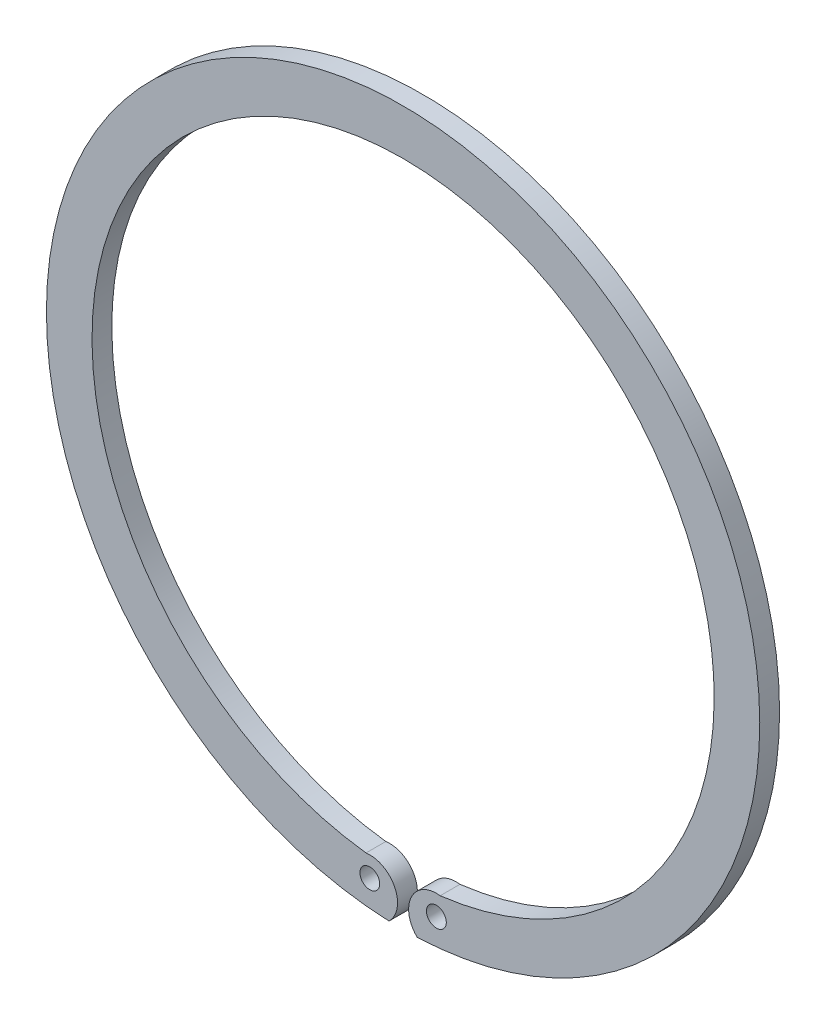
ISO-10303-21;
HEADER;
FILE_DESCRIPTION(('STEP AP214'),'2;1');
FILE_NAME('part.step','',(''),(''),'','','');
FILE_SCHEMA(('AUTOMOTIVE_DESIGN { 1 0 10303 214 1 1 1 1 }'));
ENDSEC;
DATA;
#1=APPLICATION_CONTEXT('core data for automotive mechanical design processes');
#2=APPLICATION_PROTOCOL_DEFINITION('international standard','automotive_design',2000,#1);
#3=PRODUCT_CONTEXT('',#1,'mechanical');
#4=PRODUCT('Part','Part','',(#3));
#5=PRODUCT_RELATED_PRODUCT_CATEGORY('part','',(#4));
#6=PRODUCT_DEFINITION_FORMATION('','',#4);
#7=PRODUCT_DEFINITION_CONTEXT('part definition',#1,'design');
#8=PRODUCT_DEFINITION('design','',#6,#7);
#9=PRODUCT_DEFINITION_SHAPE('','',#8);
#10=(LENGTH_UNIT() NAMED_UNIT(*) SI_UNIT(.MILLI.,.METRE.));
#11=(NAMED_UNIT(*) PLANE_ANGLE_UNIT() SI_UNIT($,.RADIAN.));
#12=(NAMED_UNIT(*) SI_UNIT($,.STERADIAN.) SOLID_ANGLE_UNIT());
#13=UNCERTAINTY_MEASURE_WITH_UNIT(LENGTH_MEASURE(1.E-05),#10,'distance_accuracy_value','');
#14=(GEOMETRIC_REPRESENTATION_CONTEXT(3) GLOBAL_UNCERTAINTY_ASSIGNED_CONTEXT((#13)) GLOBAL_UNIT_ASSIGNED_CONTEXT((#10,
#11,#12)) REPRESENTATION_CONTEXT('',''));
#15=CARTESIAN_POINT('',(0.,0.,0.));
#16=DIRECTION('',(0.,0.,1.));
#17=DIRECTION('',(1.,0.,0.));
#18=AXIS2_PLACEMENT_3D('',#15,#16,#17);
#19=CARTESIAN_POINT('',(0.,0.,-4.));
#20=DIRECTION('',(0.,0.,-1.));
#21=DIRECTION('',(1.,0.,0.));
#22=AXIS2_PLACEMENT_3D('',#19,#20,#21);
#23=CYLINDRICAL_SURFACE('',#22,62.8);
#24=DIRECTION('',(0.,0.,1.));
#25=VECTOR('',#24,1.);
#26=CARTESIAN_POINT('',(7.48440078036265,-62.3524157106917,2.));
#27=LINE('',#26,#25);
#28=CARTESIAN_POINT('',(7.48440078036292,-62.3524157106916,0.));
#29=VERTEX_POINT('',#28);
#30=CARTESIAN_POINT('',(7.48440078036265,-62.3524157106917,4.));
#31=VERTEX_POINT('',#30);
#32=EDGE_CURVE('E84',#29,#31,#27,.T.);
#33=ORIENTED_EDGE('',*,*,#32,.T.);
#34=CARTESIAN_POINT('',(0.,0.,4.));
#35=DIRECTION('',(0.,0.,-1.));
#36=DIRECTION('',(1.,0.,0.));
#37=AXIS2_PLACEMENT_3D('',#34,#35,#36);
#38=CIRCLE('',#37,62.8);
#39=CARTESIAN_POINT('',(-7.48440078036265,-62.3524157106917,4.));
#40=VERTEX_POINT('',#39);
#41=EDGE_CURVE('E78',#40,#31,#38,.T.);
#42=ORIENTED_EDGE('',*,*,#41,.F.);
#43=DIRECTION('',(0.,0.,-1.));
#44=VECTOR('',#43,1.);
#45=CARTESIAN_POINT('',(-7.48440078036265,-62.3524157106917,2.));
#46=LINE('',#45,#44);
#47=CARTESIAN_POINT('',(-7.48440078036265,-62.3524157106917,0.));
#48=VERTEX_POINT('',#47);
#49=EDGE_CURVE('E63',#40,#48,#46,.T.);
#50=ORIENTED_EDGE('',*,*,#49,.T.);
#51=CARTESIAN_POINT('',(0.,0.,0.));
#52=DIRECTION('',(0.,0.,1.));
#53=DIRECTION('',(1.,0.,0.));
#54=AXIS2_PLACEMENT_3D('',#51,#52,#53);
#55=CIRCLE('',#54,62.8);
#56=EDGE_CURVE('E11',#29,#48,#55,.T.);
#57=ORIENTED_EDGE('',*,*,#56,.F.);
#58=EDGE_LOOP('',(#33,#42,#50,#57));
#59=FACE_BOUND('',#58,.T.);
#60=ADVANCED_FACE('F16',(#59),#23,.F.);
#61=CARTESIAN_POINT('',(0.,0.,0.));
#62=DIRECTION('',(0.,0.,-1.));
#63=DIRECTION('',(-1.,0.,0.));
#64=AXIS2_PLACEMENT_3D('',#61,#62,#63);
#65=PLANE('',#64);
#66=CARTESIAN_POINT('',(0.,0.,0.));
#67=DIRECTION('',(0.,0.,-1.));
#68=DIRECTION('',(-1.,0.,0.));
#69=AXIS2_PLACEMENT_3D('',#66,#67,#68);
#70=CIRCLE('',#69,72.);
#71=CARTESIAN_POINT('',(-2.84595391443369,-71.9437318069957,0.));
#72=VERTEX_POINT('',#71);
#73=CARTESIAN_POINT('',(2.84595391443369,-71.9437318069957,0.));
#74=VERTEX_POINT('',#73);
#75=EDGE_CURVE('E19',#72,#74,#70,.T.);
#76=ORIENTED_EDGE('',*,*,#75,.T.);
#77=CARTESIAN_POINT('',(6.72,-67.9,0.));
#78=DIRECTION('',(0.,0.,-1.));
#79=DIRECTION('',(-1.,0.,0.));
#80=AXIS2_PLACEMENT_3D('',#77,#78,#79);
#81=CIRCLE('',#80,5.6);
#82=EDGE_CURVE('E100',#74,#29,#81,.T.);
#83=ORIENTED_EDGE('',*,*,#82,.T.);
#84=ORIENTED_EDGE('',*,*,#56,.T.);
#85=CARTESIAN_POINT('',(-6.72,-67.9,0.));
#86=DIRECTION('',(0.,0.,-1.));
#87=DIRECTION('',(1.,0.,0.));
#88=AXIS2_PLACEMENT_3D('',#85,#86,#87);
#89=CIRCLE('',#88,5.6);
#90=EDGE_CURVE('E25',#48,#72,#89,.T.);
#91=ORIENTED_EDGE('',*,*,#90,.T.);
#92=EDGE_LOOP('',(#76,#83,#84,#91));
#93=FACE_BOUND('',#92,.T.);
#94=CARTESIAN_POINT('',(-6.72,-66.4,0.));
#95=DIRECTION('',(0.,0.,1.));
#96=DIRECTION('',(1.,0.,0.));
#97=AXIS2_PLACEMENT_3D('',#94,#95,#96);
#98=CIRCLE('',#97,2.);
#99=CARTESIAN_POINT('',(-8.72,-66.4,0.));
#100=VERTEX_POINT('',#99);
#101=EDGE_CURVE('E96',#100,#100,#98,.T.);
#102=ORIENTED_EDGE('',*,*,#101,.T.);
#103=EDGE_LOOP('',(#102));
#104=FACE_BOUND('',#103,.T.);
#105=CARTESIAN_POINT('',(6.72,-66.4,0.));
#106=DIRECTION('',(0.,0.,1.));
#107=DIRECTION('',(1.,0.,0.));
#108=AXIS2_PLACEMENT_3D('',#105,#106,#107);
#109=CIRCLE('',#108,2.);
#110=CARTESIAN_POINT('',(4.72,-66.4,0.));
#111=VERTEX_POINT('',#110);
#112=EDGE_CURVE('E92',#111,#111,#109,.T.);
#113=ORIENTED_EDGE('',*,*,#112,.T.);
#114=EDGE_LOOP('',(#113));
#115=FACE_BOUND('',#114,.T.);
#116=ADVANCED_FACE('F105',(#93,#104,#115),#65,.T.);
#117=CARTESIAN_POINT('',(-6.72,-67.9,2.));
#118=DIRECTION('',(0.,0.,-1.));
#119=DIRECTION('',(1.,0.,0.));
#120=AXIS2_PLACEMENT_3D('',#117,#118,#119);
#121=CYLINDRICAL_SURFACE('',#120,5.6);
#122=ORIENTED_EDGE('',*,*,#49,.F.);
#123=CARTESIAN_POINT('',(-6.72,-67.9,4.));
#124=DIRECTION('',(0.,0.,1.));
#125=DIRECTION('',(1.,0.,0.));
#126=AXIS2_PLACEMENT_3D('',#123,#124,#125);
#127=CIRCLE('',#126,5.6);
#128=CARTESIAN_POINT('',(-2.84595391443369,-71.9437318069957,4.));
#129=VERTEX_POINT('',#128);
#130=EDGE_CURVE('E67',#129,#40,#127,.T.);
#131=ORIENTED_EDGE('',*,*,#130,.F.);
#132=DIRECTION('',(0.,0.,-1.));
#133=VECTOR('',#132,1.);
#134=CARTESIAN_POINT('',(-2.84595391443369,-71.9437318069957,2.));
#135=LINE('',#134,#133);
#136=EDGE_CURVE('E71',#129,#72,#135,.T.);
#137=ORIENTED_EDGE('',*,*,#136,.T.);
#138=ORIENTED_EDGE('',*,*,#90,.F.);
#139=EDGE_LOOP('',(#122,#131,#137,#138));
#140=FACE_BOUND('',#139,.T.);
#141=ADVANCED_FACE('F65',(#140),#121,.T.);
#142=CARTESIAN_POINT('',(0.,0.,2.));
#143=DIRECTION('',(0.,0.,-1.));
#144=DIRECTION('',(1.,0.,0.));
#145=AXIS2_PLACEMENT_3D('',#142,#143,#144);
#146=CYLINDRICAL_SURFACE('',#145,72.);
#147=CARTESIAN_POINT('',(0.,0.,4.));
#148=DIRECTION('',(0.,0.,1.));
#149=DIRECTION('',(1.,0.,0.));
#150=AXIS2_PLACEMENT_3D('',#147,#148,#149);
#151=CIRCLE('',#150,72.);
#152=CARTESIAN_POINT('',(2.84595391443369,-71.9437318069957,4.));
#153=VERTEX_POINT('',#152);
#154=EDGE_CURVE('E80',#153,#129,#151,.T.);
#155=ORIENTED_EDGE('',*,*,#154,.F.);
#156=DIRECTION('',(0.,0.,1.));
#157=VECTOR('',#156,1.);
#158=CARTESIAN_POINT('',(2.84595391443369,-71.9437318069957,2.));
#159=LINE('',#158,#157);
#160=EDGE_CURVE('E88',#74,#153,#159,.T.);
#161=ORIENTED_EDGE('',*,*,#160,.F.);
#162=ORIENTED_EDGE('',*,*,#75,.F.);
#163=ORIENTED_EDGE('',*,*,#136,.F.);
#164=EDGE_LOOP('',(#155,#161,#162,#163));
#165=FACE_BOUND('',#164,.T.);
#166=ADVANCED_FACE('F112',(#165),#146,.T.);
#167=CARTESIAN_POINT('',(0.,0.,4.));
#168=DIRECTION('',(0.,0.,1.));
#169=DIRECTION('',(1.,0.,0.));
#170=AXIS2_PLACEMENT_3D('',#167,#168,#169);
#171=PLANE('',#170);
#172=ORIENTED_EDGE('',*,*,#41,.T.);
#173=CARTESIAN_POINT('',(6.72,-67.9,4.));
#174=DIRECTION('',(0.,0.,1.));
#175=DIRECTION('',(-1.,0.,0.));
#176=AXIS2_PLACEMENT_3D('',#173,#174,#175);
#177=CIRCLE('',#176,5.6);
#178=EDGE_CURVE('E85',#31,#153,#177,.T.);
#179=ORIENTED_EDGE('',*,*,#178,.T.);
#180=ORIENTED_EDGE('',*,*,#154,.T.);
#181=ORIENTED_EDGE('',*,*,#130,.T.);
#182=EDGE_LOOP('',(#172,#179,#180,#181));
#183=FACE_BOUND('',#182,.T.);
#184=CARTESIAN_POINT('',(-6.72,-66.4,4.));
#185=DIRECTION('',(0.,0.,-1.));
#186=DIRECTION('',(1.,0.,0.));
#187=AXIS2_PLACEMENT_3D('',#184,#185,#186);
#188=CIRCLE('',#187,2.);
#189=CARTESIAN_POINT('',(-8.72,-66.4,4.));
#190=VERTEX_POINT('',#189);
#191=EDGE_CURVE('E97',#190,#190,#188,.T.);
#192=ORIENTED_EDGE('',*,*,#191,.T.);
#193=EDGE_LOOP('',(#192));
#194=FACE_BOUND('',#193,.T.);
#195=CARTESIAN_POINT('',(6.72,-66.4,4.));
#196=DIRECTION('',(0.,0.,-1.));
#197=DIRECTION('',(1.,0.,0.));
#198=AXIS2_PLACEMENT_3D('',#195,#196,#197);
#199=CIRCLE('',#198,2.);
#200=CARTESIAN_POINT('',(4.72,-66.4,4.));
#201=VERTEX_POINT('',#200);
#202=EDGE_CURVE('E94',#201,#201,#199,.T.);
#203=ORIENTED_EDGE('',*,*,#202,.T.);
#204=EDGE_LOOP('',(#203));
#205=FACE_BOUND('',#204,.T.);
#206=ADVANCED_FACE('F75',(#183,#194,#205),#171,.T.);
#207=CARTESIAN_POINT('',(6.72,-67.9,2.));
#208=DIRECTION('',(0.,0.,1.));
#209=DIRECTION('',(-1.,0.,0.));
#210=AXIS2_PLACEMENT_3D('',#207,#208,#209);
#211=CYLINDRICAL_SURFACE('',#210,5.6);
#212=ORIENTED_EDGE('',*,*,#32,.F.);
#213=ORIENTED_EDGE('',*,*,#82,.F.);
#214=ORIENTED_EDGE('',*,*,#160,.T.);
#215=ORIENTED_EDGE('',*,*,#178,.F.);
#216=EDGE_LOOP('',(#212,#213,#214,#215));
#217=FACE_BOUND('',#216,.T.);
#218=ADVANCED_FACE('F110',(#217),#211,.T.);
#219=CARTESIAN_POINT('',(-6.72,-66.4,2.));
#220=DIRECTION('',(0.,0.,-1.));
#221=DIRECTION('',(1.,0.,0.));
#222=AXIS2_PLACEMENT_3D('',#219,#220,#221);
#223=CYLINDRICAL_SURFACE('',#222,2.);
#224=ORIENTED_EDGE('',*,*,#191,.F.);
#225=EDGE_LOOP('',(#224));
#226=FACE_BOUND('',#225,.T.);
#227=ORIENTED_EDGE('',*,*,#101,.F.);
#228=EDGE_LOOP('',(#227));
#229=FACE_BOUND('',#228,.T.);
#230=ADVANCED_FACE('F129',(#226,#229),#223,.F.);
#231=CARTESIAN_POINT('',(6.72,-66.4,2.));
#232=DIRECTION('',(0.,0.,-1.));
#233=DIRECTION('',(1.,0.,0.));
#234=AXIS2_PLACEMENT_3D('',#231,#232,#233);
#235=CYLINDRICAL_SURFACE('',#234,2.);
#236=ORIENTED_EDGE('',*,*,#202,.F.);
#237=EDGE_LOOP('',(#236));
#238=FACE_BOUND('',#237,.T.);
#239=ORIENTED_EDGE('',*,*,#112,.F.);
#240=EDGE_LOOP('',(#239));
#241=FACE_BOUND('',#240,.T.);
#242=ADVANCED_FACE('F131',(#238,#241),#235,.F.);
#243=CLOSED_SHELL('',(#60,#116,#141,#166,#206,#218,#230,#242));
#244=MANIFOLD_SOLID_BREP('B1',#243);
#245=ADVANCED_BREP_SHAPE_REPRESENTATION('',(#18,#244),#14);
#246=SHAPE_DEFINITION_REPRESENTATION(#9,#245);
ENDSEC;
END-ISO-10303-21;
